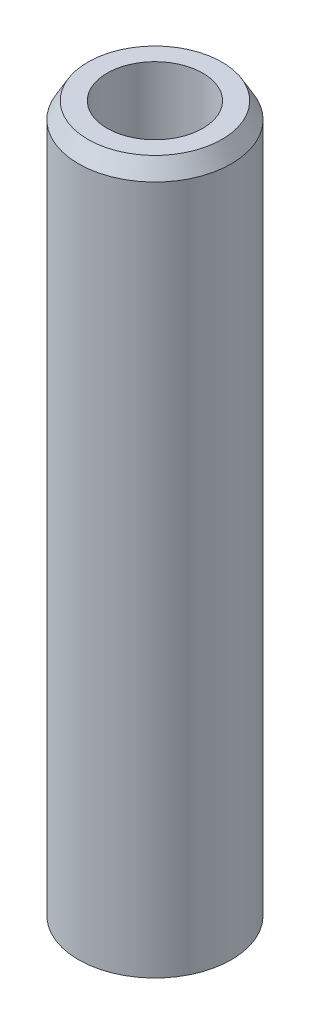
ISO-10303-21;
HEADER;
FILE_DESCRIPTION(('STEP AP214'),'2;1');
FILE_NAME('part.step','',(''),(''),'','','');
FILE_SCHEMA(('AUTOMOTIVE_DESIGN { 1 0 10303 214 1 1 1 1 }'));
ENDSEC;
DATA;
#1=APPLICATION_CONTEXT('core data for automotive mechanical design processes');
#2=APPLICATION_PROTOCOL_DEFINITION('international standard','automotive_design',2000,#1);
#3=PRODUCT_CONTEXT('',#1,'mechanical');
#4=PRODUCT('Part','Part','',(#3));
#5=PRODUCT_RELATED_PRODUCT_CATEGORY('part','',(#4));
#6=PRODUCT_DEFINITION_FORMATION('','',#4);
#7=PRODUCT_DEFINITION_CONTEXT('part definition',#1,'design');
#8=PRODUCT_DEFINITION('design','',#6,#7);
#9=PRODUCT_DEFINITION_SHAPE('','',#8);
#10=(LENGTH_UNIT() NAMED_UNIT(*) SI_UNIT(.MILLI.,.METRE.));
#11=(NAMED_UNIT(*) PLANE_ANGLE_UNIT() SI_UNIT($,.RADIAN.));
#12=(NAMED_UNIT(*) SI_UNIT($,.STERADIAN.) SOLID_ANGLE_UNIT());
#13=UNCERTAINTY_MEASURE_WITH_UNIT(LENGTH_MEASURE(1.E-05),#10,'distance_accuracy_value','');
#14=(GEOMETRIC_REPRESENTATION_CONTEXT(3) GLOBAL_UNCERTAINTY_ASSIGNED_CONTEXT((#13)) GLOBAL_UNIT_ASSIGNED_CONTEXT((#10,
#11,#12)) REPRESENTATION_CONTEXT('',''));
#15=CARTESIAN_POINT('',(0.,0.,0.));
#16=DIRECTION('',(0.,0.,1.));
#17=DIRECTION('',(1.,0.,0.));
#18=AXIS2_PLACEMENT_3D('',#15,#16,#17);
#19=CARTESIAN_POINT('',(0.,70.1267573367925,0.));
#20=DIRECTION('',(0.,-1.,0.));
#21=DIRECTION('',(0.,0.,-1.));
#22=AXIS2_PLACEMENT_3D('',#19,#20,#21);
#23=CYLINDRICAL_SURFACE('',#22,7.5);
#24=CARTESIAN_POINT('',(0.,68.5190893325522,0.));
#25=DIRECTION('',(0.,1.,0.));
#26=DIRECTION('',(0.,0.,1.));
#27=AXIS2_PLACEMENT_3D('',#24,#25,#26);
#28=CIRCLE('',#27,7.5);
#29=CARTESIAN_POINT('',(0.,68.5190893325522,7.5));
#30=VERTEX_POINT('',#29);
#31=EDGE_CURVE('E50',#30,#30,#28,.F.);
#32=ORIENTED_EDGE('',*,*,#31,.T.);
#33=EDGE_LOOP('',(#32));
#34=FACE_BOUND('',#33,.T.);
#35=CARTESIAN_POINT('',(0.,0.928187555015683,0.));
#36=DIRECTION('',(0.,1.,0.));
#37=DIRECTION('',(0.,0.,1.));
#38=AXIS2_PLACEMENT_3D('',#35,#36,#37);
#39=CIRCLE('',#38,7.5);
#40=CARTESIAN_POINT('',(0.,0.928187555015683,7.5));
#41=VERTEX_POINT('',#40);
#42=EDGE_CURVE('E51',#41,#41,#39,.T.);
#43=ORIENTED_EDGE('',*,*,#42,.T.);
#44=EDGE_LOOP('',(#43));
#45=FACE_BOUND('',#44,.T.);
#46=ADVANCED_FACE('F39',(#34,#45),#23,.T.);
#47=CARTESIAN_POINT('',(0.,70.1267573367925,0.));
#48=DIRECTION('',(0.,1.,0.));
#49=DIRECTION('',(0.,0.,1.));
#50=AXIS2_PLACEMENT_3D('',#47,#48,#49);
#51=PLANE('',#50);
#52=CARTESIAN_POINT('',(0.,70.1267573367925,0.));
#53=DIRECTION('',(0.,1.,0.));
#54=DIRECTION('',(0.,0.,1.));
#55=AXIS2_PLACEMENT_3D('',#52,#53,#54);
#56=CIRCLE('',#55,6.5718124449843);
#57=CARTESIAN_POINT('',(0.,70.1267573367925,6.5718124449843));
#58=VERTEX_POINT('',#57);
#59=EDGE_CURVE('E54',#58,#58,#56,.T.);
#60=ORIENTED_EDGE('',*,*,#59,.T.);
#61=EDGE_LOOP('',(#60));
#62=FACE_BOUND('',#61,.T.);
#63=CARTESIAN_POINT('',(0.,70.1267573367925,0.));
#64=DIRECTION('',(0.,1.,0.));
#65=DIRECTION('',(0.,0.,1.));
#66=AXIS2_PLACEMENT_3D('',#63,#64,#65);
#67=CIRCLE('',#66,4.69217593851667);
#68=CARTESIAN_POINT('',(0.,70.1267573367925,4.69217593851667));
#69=VERTEX_POINT('',#68);
#70=EDGE_CURVE('E58',#69,#69,#67,.T.);
#71=ORIENTED_EDGE('',*,*,#70,.F.);
#72=EDGE_LOOP('',(#71));
#73=FACE_BOUND('',#72,.T.);
#74=ADVANCED_FACE('F69',(#62,#73),#51,.T.);
#75=CARTESIAN_POINT('',(0.,0.,0.));
#76=DIRECTION('',(0.,1.,0.));
#77=DIRECTION('',(0.,0.,1.));
#78=AXIS2_PLACEMENT_3D('',#75,#76,#77);
#79=PLANE('',#78);
#80=CARTESIAN_POINT('',(0.,0.,0.));
#81=DIRECTION('',(0.,1.,0.));
#82=DIRECTION('',(0.,0.,1.));
#83=AXIS2_PLACEMENT_3D('',#80,#81,#82);
#84=CIRCLE('',#83,5.8923319957597);
#85=CARTESIAN_POINT('',(0.,0.,5.8923319957597));
#86=VERTEX_POINT('',#85);
#87=EDGE_CURVE('E10',#86,#86,#84,.F.);
#88=ORIENTED_EDGE('',*,*,#87,.T.);
#89=EDGE_LOOP('',(#88));
#90=FACE_BOUND('',#89,.T.);
#91=CARTESIAN_POINT('',(0.,0.,0.));
#92=DIRECTION('',(0.,1.,0.));
#93=DIRECTION('',(0.,0.,1.));
#94=AXIS2_PLACEMENT_3D('',#91,#92,#93);
#95=CIRCLE('',#94,4.69217593851667);
#96=CARTESIAN_POINT('',(0.,0.,4.69217593851667));
#97=VERTEX_POINT('',#96);
#98=EDGE_CURVE('E63',#97,#97,#95,.T.);
#99=ORIENTED_EDGE('',*,*,#98,.T.);
#100=EDGE_LOOP('',(#99));
#101=FACE_BOUND('',#100,.T.);
#102=ADVANCED_FACE('F75',(#90,#101),#79,.F.);
#103=CARTESIAN_POINT('',(0.,70.1267573367925,0.));
#104=DIRECTION('',(0.,-1.,0.));
#105=DIRECTION('',(0.,0.,-1.));
#106=AXIS2_PLACEMENT_3D('',#103,#104,#105);
#107=CYLINDRICAL_SURFACE('',#106,4.69217593851667);
#108=ORIENTED_EDGE('',*,*,#70,.T.);
#109=EDGE_LOOP('',(#108));
#110=FACE_BOUND('',#109,.T.);
#111=ORIENTED_EDGE('',*,*,#98,.F.);
#112=EDGE_LOOP('',(#111));
#113=FACE_BOUND('',#112,.T.);
#114=ADVANCED_FACE('F70',(#110,#113),#107,.F.);
#115=CARTESIAN_POINT('',(0.,70.1267573367925,0.));
#116=DIRECTION('',(0.,-1.,0.));
#117=DIRECTION('',(0.,0.,-1.));
#118=AXIS2_PLACEMENT_3D('',#115,#116,#117);
#119=CONICAL_SURFACE('',#118,6.5718124449843,0.523598775598298);
#120=ORIENTED_EDGE('',*,*,#31,.F.);
#121=EDGE_LOOP('',(#120));
#122=FACE_BOUND('',#121,.T.);
#123=ORIENTED_EDGE('',*,*,#59,.F.);
#124=EDGE_LOOP('',(#123));
#125=FACE_BOUND('',#124,.T.);
#126=ADVANCED_FACE('F81',(#122,#125),#119,.T.);
#127=CARTESIAN_POINT('',(0.,0.928187555015683,0.));
#128=DIRECTION('',(0.,1.,0.));
#129=DIRECTION('',(0.,0.,1.));
#130=AXIS2_PLACEMENT_3D('',#127,#128,#129);
#131=CONICAL_SURFACE('',#130,7.5,1.0471975511966);
#132=ORIENTED_EDGE('',*,*,#87,.F.);
#133=EDGE_LOOP('',(#132));
#134=FACE_BOUND('',#133,.T.);
#135=ORIENTED_EDGE('',*,*,#42,.F.);
#136=EDGE_LOOP('',(#135));
#137=FACE_BOUND('',#136,.T.);
#138=ADVANCED_FACE('F45',(#134,#137),#131,.T.);
#139=CLOSED_SHELL('',(#46,#74,#102,#114,#126,#138));
#140=MANIFOLD_SOLID_BREP('B2',#139);
#141=ADVANCED_BREP_SHAPE_REPRESENTATION('',(#18,#140),#14);
#142=SHAPE_DEFINITION_REPRESENTATION(#9,#141);
ENDSEC;
END-ISO-10303-21;
